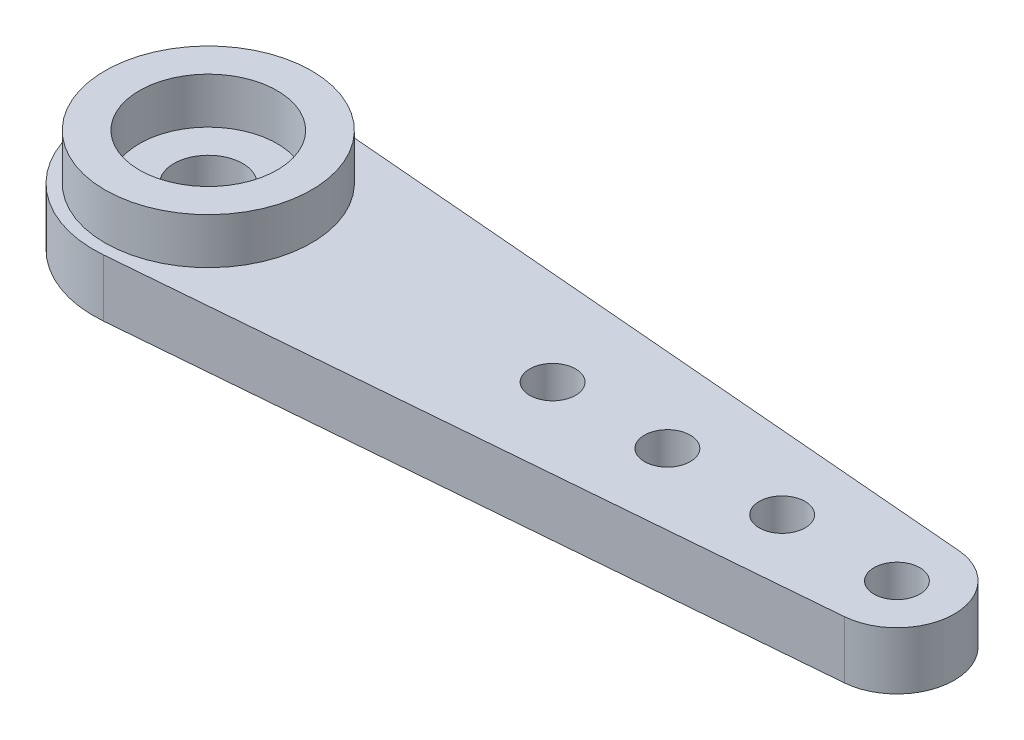
ISO-10303-21;
HEADER;
FILE_DESCRIPTION(('STEP AP214'),'2;1');
FILE_NAME('part.step','',(''),(''),'','','');
FILE_SCHEMA(('AUTOMOTIVE_DESIGN { 1 0 10303 214 1 1 1 1 }'));
ENDSEC;
DATA;
#1=APPLICATION_CONTEXT('core data for automotive mechanical design processes');
#2=APPLICATION_PROTOCOL_DEFINITION('international standard','automotive_design',2000,#1);
#3=PRODUCT_CONTEXT('',#1,'mechanical');
#4=PRODUCT('Part','Part','',(#3));
#5=PRODUCT_RELATED_PRODUCT_CATEGORY('part','',(#4));
#6=PRODUCT_DEFINITION_FORMATION('','',#4);
#7=PRODUCT_DEFINITION_CONTEXT('part definition',#1,'design');
#8=PRODUCT_DEFINITION('design','',#6,#7);
#9=PRODUCT_DEFINITION_SHAPE('','',#8);
#10=(LENGTH_UNIT() NAMED_UNIT(*) SI_UNIT(.MILLI.,.METRE.));
#11=(NAMED_UNIT(*) PLANE_ANGLE_UNIT() SI_UNIT($,.RADIAN.));
#12=(NAMED_UNIT(*) SI_UNIT($,.STERADIAN.) SOLID_ANGLE_UNIT());
#13=UNCERTAINTY_MEASURE_WITH_UNIT(LENGTH_MEASURE(1.E-05),#10,'distance_accuracy_value','');
#14=(GEOMETRIC_REPRESENTATION_CONTEXT(3) GLOBAL_UNCERTAINTY_ASSIGNED_CONTEXT((#13)) GLOBAL_UNIT_ASSIGNED_CONTEXT((#10,
#11,#12)) REPRESENTATION_CONTEXT('',''));
#15=CARTESIAN_POINT('',(0.,0.,0.));
#16=DIRECTION('',(0.,0.,1.));
#17=DIRECTION('',(1.,0.,0.));
#18=AXIS2_PLACEMENT_3D('',#15,#16,#17);
#19=CARTESIAN_POINT('',(-30.,0.,0.));
#20=DIRECTION('',(0.,1.,0.));
#21=DIRECTION('',(0.,0.,1.));
#22=AXIS2_PLACEMENT_3D('',#19,#20,#21);
#23=CYLINDRICAL_SURFACE('',#22,1.5);
#24=CARTESIAN_POINT('',(-30.,2.5,0.));
#25=DIRECTION('',(0.,1.,0.));
#26=DIRECTION('',(0.,0.,1.));
#27=AXIS2_PLACEMENT_3D('',#24,#25,#26);
#28=CIRCLE('',#27,1.5);
#29=CARTESIAN_POINT('',(-30.,2.5,1.5));
#30=VERTEX_POINT('',#29);
#31=EDGE_CURVE('E311',#30,#30,#28,.T.);
#32=ORIENTED_EDGE('',*,*,#31,.T.);
#33=EDGE_LOOP('',(#32));
#34=FACE_BOUND('',#33,.T.);
#35=CARTESIAN_POINT('',(-30.,0.2,0.));
#36=DIRECTION('',(0.,-1.,0.));
#37=DIRECTION('',(0.,0.,-1.));
#38=AXIS2_PLACEMENT_3D('',#35,#36,#37);
#39=CIRCLE('',#38,1.5);
#40=CARTESIAN_POINT('',(-30.,0.2,-1.5));
#41=VERTEX_POINT('',#40);
#42=EDGE_CURVE('E43',#41,#41,#39,.F.);
#43=ORIENTED_EDGE('',*,*,#42,.F.);
#44=EDGE_LOOP('',(#43));
#45=FACE_BOUND('',#44,.T.);
#46=ADVANCED_FACE('F39',(#34,#45),#23,.F.);
#47=CARTESIAN_POINT('',(-30.,2.5,0.));
#48=DIRECTION('',(0.,-1.,0.));
#49=DIRECTION('',(0.,0.,-1.));
#50=AXIS2_PLACEMENT_3D('',#47,#48,#49);
#51=CYLINDRICAL_SURFACE('',#50,5.);
#52=CARTESIAN_POINT('',(-30.,0.,0.));
#53=DIRECTION('',(0.,1.,0.));
#54=DIRECTION('',(0.,0.,1.));
#55=AXIS2_PLACEMENT_3D('',#52,#53,#54);
#56=CIRCLE('',#55,5.);
#57=CARTESIAN_POINT('',(-29.5833333333333,0.,-4.98260864295891));
#58=VERTEX_POINT('',#57);
#59=CARTESIAN_POINT('',(-29.5833333333333,0.,4.98260864295892));
#60=VERTEX_POINT('',#59);
#61=EDGE_CURVE('E121',#58,#60,#56,.T.);
#62=ORIENTED_EDGE('',*,*,#61,.T.);
#63=DIRECTION('',(0.,-1.,0.));
#64=VECTOR('',#63,1.);
#65=CARTESIAN_POINT('',(-29.5833333333333,2.5,4.98260864295892));
#66=LINE('',#65,#64);
#67=CARTESIAN_POINT('',(-29.5833333333333,2.5,4.98260864295892));
#68=VERTEX_POINT('',#67);
#69=EDGE_CURVE('E49',#68,#60,#66,.T.);
#70=ORIENTED_EDGE('',*,*,#69,.F.);
#71=CARTESIAN_POINT('',(-30.,2.5,0.));
#72=DIRECTION('',(0.,1.,0.));
#73=DIRECTION('',(0.,0.,1.));
#74=AXIS2_PLACEMENT_3D('',#71,#72,#73);
#75=CIRCLE('',#74,5.);
#76=CARTESIAN_POINT('',(-29.5833333333333,2.5,-4.98260864295891));
#77=VERTEX_POINT('',#76);
#78=EDGE_CURVE('E93',#77,#68,#75,.T.);
#79=ORIENTED_EDGE('',*,*,#78,.F.);
#80=DIRECTION('',(0.,-1.,0.));
#81=VECTOR('',#80,1.);
#82=CARTESIAN_POINT('',(-29.5833333333333,2.5,-4.98260864295891));
#83=LINE('',#82,#81);
#84=EDGE_CURVE('E58',#77,#58,#83,.T.);
#85=ORIENTED_EDGE('',*,*,#84,.T.);
#86=EDGE_LOOP('',(#62,#70,#79,#85));
#87=FACE_BOUND('',#86,.T.);
#88=ADVANCED_FACE('F41',(#87),#51,.T.);
#89=CARTESIAN_POINT('',(0.208333333333333,2.5,2.49130432147946));
#90=DIRECTION('',(-0.0833333333333334,0.,-0.996521728591783));
#91=DIRECTION('',(-0.996521728591783,0.,0.0833333333333334));
#92=AXIS2_PLACEMENT_3D('',#89,#90,#91);
#93=PLANE('',#92);
#94=DIRECTION('',(0.996521728591783,0.,-0.0833333333333334));
#95=VECTOR('',#94,1.);
#96=CARTESIAN_POINT('',(0.208333333333333,0.,2.49130432147946));
#97=LINE('',#96,#95);
#98=CARTESIAN_POINT('',(0.208333333333335,0.,2.49130432147946));
#99=VERTEX_POINT('',#98);
#100=EDGE_CURVE('E99',#60,#99,#97,.T.);
#101=ORIENTED_EDGE('',*,*,#100,.T.);
#102=DIRECTION('',(0.,-1.,0.));
#103=VECTOR('',#102,1.);
#104=CARTESIAN_POINT('',(0.208333333333335,2.5,2.49130432147946));
#105=LINE('',#104,#103);
#106=CARTESIAN_POINT('',(0.208333333333335,2.5,2.49130432147946));
#107=VERTEX_POINT('',#106);
#108=EDGE_CURVE('E97',#107,#99,#105,.T.);
#109=ORIENTED_EDGE('',*,*,#108,.F.);
#110=DIRECTION('',(0.996521728591783,0.,-0.0833333333333334));
#111=VECTOR('',#110,1.);
#112=CARTESIAN_POINT('',(0.208333333333333,2.5,2.49130432147946));
#113=LINE('',#112,#111);
#114=EDGE_CURVE('E85',#68,#107,#113,.T.);
#115=ORIENTED_EDGE('',*,*,#114,.F.);
#116=ORIENTED_EDGE('',*,*,#69,.T.);
#117=EDGE_LOOP('',(#101,#109,#115,#116));
#118=FACE_BOUND('',#117,.T.);
#119=ADVANCED_FACE('F98',(#118),#93,.F.);
#120=CARTESIAN_POINT('',(0.,2.5,0.));
#121=DIRECTION('',(0.,-1.,0.));
#122=DIRECTION('',(0.,0.,-1.));
#123=AXIS2_PLACEMENT_3D('',#120,#121,#122);
#124=CYLINDRICAL_SURFACE('',#123,2.5);
#125=CARTESIAN_POINT('',(0.,0.,0.));
#126=DIRECTION('',(0.,1.,0.));
#127=DIRECTION('',(0.,0.,1.));
#128=AXIS2_PLACEMENT_3D('',#125,#126,#127);
#129=CIRCLE('',#128,2.5);
#130=CARTESIAN_POINT('',(0.208333333333334,0.,-2.49130432147946));
#131=VERTEX_POINT('',#130);
#132=EDGE_CURVE('E125',#99,#131,#129,.T.);
#133=ORIENTED_EDGE('',*,*,#132,.T.);
#134=DIRECTION('',(0.,-1.,0.));
#135=VECTOR('',#134,1.);
#136=CARTESIAN_POINT('',(0.208333333333334,2.5,-2.49130432147946));
#137=LINE('',#136,#135);
#138=CARTESIAN_POINT('',(0.208333333333334,2.5,-2.49130432147946));
#139=VERTEX_POINT('',#138);
#140=EDGE_CURVE('E73',#139,#131,#137,.T.);
#141=ORIENTED_EDGE('',*,*,#140,.F.);
#142=CARTESIAN_POINT('',(0.,2.5,0.));
#143=DIRECTION('',(0.,1.,0.));
#144=DIRECTION('',(0.,0.,1.));
#145=AXIS2_PLACEMENT_3D('',#142,#143,#144);
#146=CIRCLE('',#145,2.5);
#147=EDGE_CURVE('E92',#107,#139,#146,.T.);
#148=ORIENTED_EDGE('',*,*,#147,.F.);
#149=ORIENTED_EDGE('',*,*,#108,.T.);
#150=EDGE_LOOP('',(#133,#141,#148,#149));
#151=FACE_BOUND('',#150,.T.);
#152=ADVANCED_FACE('F103',(#151),#124,.T.);
#153=CARTESIAN_POINT('',(-5.,2.5,0.));
#154=DIRECTION('',(0.,-1.,0.));
#155=DIRECTION('',(0.,0.,-1.));
#156=AXIS2_PLACEMENT_3D('',#153,#154,#155);
#157=CYLINDRICAL_SURFACE('',#156,1.);
#158=CARTESIAN_POINT('',(-5.,2.5,0.));
#159=DIRECTION('',(0.,1.,0.));
#160=DIRECTION('',(0.,0.,1.));
#161=AXIS2_PLACEMENT_3D('',#158,#159,#160);
#162=CIRCLE('',#161,1.);
#163=CARTESIAN_POINT('',(-5.,2.5,1.00000000000003));
#164=VERTEX_POINT('',#163);
#165=EDGE_CURVE('E115',#164,#164,#162,.T.);
#166=ORIENTED_EDGE('',*,*,#165,.T.);
#167=EDGE_LOOP('',(#166));
#168=FACE_BOUND('',#167,.T.);
#169=CARTESIAN_POINT('',(-5.,0.,0.));
#170=DIRECTION('',(0.,1.,0.));
#171=DIRECTION('',(0.,0.,1.));
#172=AXIS2_PLACEMENT_3D('',#169,#170,#171);
#173=CIRCLE('',#172,1.);
#174=CARTESIAN_POINT('',(-5.,0.,1.00000000000003));
#175=VERTEX_POINT('',#174);
#176=EDGE_CURVE('E136',#175,#175,#173,.T.);
#177=ORIENTED_EDGE('',*,*,#176,.F.);
#178=EDGE_LOOP('',(#177));
#179=FACE_BOUND('',#178,.T.);
#180=ADVANCED_FACE('F192',(#168,#179),#157,.F.);
#181=CARTESIAN_POINT('',(-10.,2.5,0.));
#182=DIRECTION('',(0.,-1.,0.));
#183=DIRECTION('',(0.,0.,-1.));
#184=AXIS2_PLACEMENT_3D('',#181,#182,#183);
#185=CYLINDRICAL_SURFACE('',#184,1.);
#186=CARTESIAN_POINT('',(-10.,2.5,0.));
#187=DIRECTION('',(0.,1.,0.));
#188=DIRECTION('',(0.,0.,1.));
#189=AXIS2_PLACEMENT_3D('',#186,#187,#188);
#190=CIRCLE('',#189,1.);
#191=CARTESIAN_POINT('',(-10.,2.5,1.00000000000007));
#192=VERTEX_POINT('',#191);
#193=EDGE_CURVE('E112',#192,#192,#190,.T.);
#194=ORIENTED_EDGE('',*,*,#193,.T.);
#195=EDGE_LOOP('',(#194));
#196=FACE_BOUND('',#195,.T.);
#197=CARTESIAN_POINT('',(-10.,0.,0.));
#198=DIRECTION('',(0.,1.,0.));
#199=DIRECTION('',(0.,0.,1.));
#200=AXIS2_PLACEMENT_3D('',#197,#198,#199);
#201=CIRCLE('',#200,1.);
#202=CARTESIAN_POINT('',(-10.,0.,1.00000000000007));
#203=VERTEX_POINT('',#202);
#204=EDGE_CURVE('E133',#203,#203,#201,.T.);
#205=ORIENTED_EDGE('',*,*,#204,.F.);
#206=EDGE_LOOP('',(#205));
#207=FACE_BOUND('',#206,.T.);
#208=ADVANCED_FACE('F157',(#196,#207),#185,.F.);
#209=CARTESIAN_POINT('',(-15.,2.5,1.04744440165294E-13));
#210=DIRECTION('',(0.,-1.,0.));
#211=DIRECTION('',(0.,0.,-1.));
#212=AXIS2_PLACEMENT_3D('',#209,#210,#211);
#213=CYLINDRICAL_SURFACE('',#212,1.);
#214=CARTESIAN_POINT('',(-15.,2.5,1.04744440165294E-13));
#215=DIRECTION('',(0.,1.,0.));
#216=DIRECTION('',(0.,0.,1.));
#217=AXIS2_PLACEMENT_3D('',#214,#215,#216);
#218=CIRCLE('',#217,1.);
#219=CARTESIAN_POINT('',(-15.,2.5,1.0000000000001));
#220=VERTEX_POINT('',#219);
#221=EDGE_CURVE('E106',#220,#220,#218,.T.);
#222=ORIENTED_EDGE('',*,*,#221,.T.);
#223=EDGE_LOOP('',(#222));
#224=FACE_BOUND('',#223,.T.);
#225=CARTESIAN_POINT('',(-15.,0.,1.04744440165294E-13));
#226=DIRECTION('',(0.,1.,0.));
#227=DIRECTION('',(0.,0.,1.));
#228=AXIS2_PLACEMENT_3D('',#225,#226,#227);
#229=CIRCLE('',#228,1.);
#230=CARTESIAN_POINT('',(-15.,0.,1.0000000000001));
#231=VERTEX_POINT('',#230);
#232=EDGE_CURVE('E130',#231,#231,#229,.T.);
#233=ORIENTED_EDGE('',*,*,#232,.F.);
#234=EDGE_LOOP('',(#233));
#235=FACE_BOUND('',#234,.T.);
#236=ADVANCED_FACE('F149',(#224,#235),#213,.F.);
#237=CARTESIAN_POINT('',(0.208333333333333,2.5,-2.49130432147946));
#238=DIRECTION('',(0.0833333333333331,0.,-0.996521728591783));
#239=DIRECTION('',(-0.996521728591783,0.,-0.0833333333333331));
#240=AXIS2_PLACEMENT_3D('',#237,#238,#239);
#241=PLANE('',#240);
#242=DIRECTION('',(0.996521728591783,0.,0.0833333333333331));
#243=VECTOR('',#242,1.);
#244=CARTESIAN_POINT('',(0.208333333333333,0.,-2.49130432147946));
#245=LINE('',#244,#243);
#246=EDGE_CURVE('E127',#58,#131,#245,.T.);
#247=ORIENTED_EDGE('',*,*,#246,.F.);
#248=ORIENTED_EDGE('',*,*,#84,.F.);
#249=DIRECTION('',(0.996521728591783,0.,0.0833333333333331));
#250=VECTOR('',#249,1.);
#251=CARTESIAN_POINT('',(0.208333333333333,2.5,-2.49130432147946));
#252=LINE('',#251,#250);
#253=EDGE_CURVE('E104',#77,#139,#252,.T.);
#254=ORIENTED_EDGE('',*,*,#253,.T.);
#255=ORIENTED_EDGE('',*,*,#140,.T.);
#256=EDGE_LOOP('',(#247,#248,#254,#255));
#257=FACE_BOUND('',#256,.T.);
#258=ADVANCED_FACE('F146',(#257),#241,.T.);
#259=CARTESIAN_POINT('',(0.,2.5,0.));
#260=DIRECTION('',(0.,-1.,0.));
#261=DIRECTION('',(0.,0.,-1.));
#262=AXIS2_PLACEMENT_3D('',#259,#260,#261);
#263=CYLINDRICAL_SURFACE('',#262,1.);
#264=CARTESIAN_POINT('',(0.,2.5,0.));
#265=DIRECTION('',(0.,1.,0.));
#266=DIRECTION('',(0.,0.,1.));
#267=AXIS2_PLACEMENT_3D('',#264,#265,#266);
#268=CIRCLE('',#267,1.);
#269=CARTESIAN_POINT('',(0.,2.5,1.));
#270=VERTEX_POINT('',#269);
#271=EDGE_CURVE('E118',#270,#270,#268,.T.);
#272=ORIENTED_EDGE('',*,*,#271,.T.);
#273=EDGE_LOOP('',(#272));
#274=FACE_BOUND('',#273,.T.);
#275=CARTESIAN_POINT('',(0.,0.,0.));
#276=DIRECTION('',(0.,1.,0.));
#277=DIRECTION('',(0.,0.,1.));
#278=AXIS2_PLACEMENT_3D('',#275,#276,#277);
#279=CIRCLE('',#278,1.);
#280=CARTESIAN_POINT('',(0.,0.,1.));
#281=VERTEX_POINT('',#280);
#282=EDGE_CURVE('E139',#281,#281,#279,.T.);
#283=ORIENTED_EDGE('',*,*,#282,.F.);
#284=EDGE_LOOP('',(#283));
#285=FACE_BOUND('',#284,.T.);
#286=ADVANCED_FACE('F148',(#274,#285),#263,.F.);
#287=CARTESIAN_POINT('',(0.,2.5,0.));
#288=DIRECTION('',(0.,1.,0.));
#289=DIRECTION('',(0.,0.,1.));
#290=AXIS2_PLACEMENT_3D('',#287,#288,#289);
#291=PLANE('',#290);
#292=CARTESIAN_POINT('',(-30.,2.5,0.));
#293=DIRECTION('',(0.,1.,0.));
#294=DIRECTION('',(0.,0.,1.));
#295=AXIS2_PLACEMENT_3D('',#292,#293,#294);
#296=CIRCLE('',#295,4.5);
#297=CARTESIAN_POINT('',(-30.,2.5,4.5));
#298=VERTEX_POINT('',#297);
#299=EDGE_CURVE('E11',#298,#298,#296,.T.);
#300=ORIENTED_EDGE('',*,*,#299,.F.);
#301=EDGE_LOOP('',(#300));
#302=FACE_BOUND('',#301,.T.);
#303=ORIENTED_EDGE('',*,*,#78,.T.);
#304=ORIENTED_EDGE('',*,*,#114,.T.);
#305=ORIENTED_EDGE('',*,*,#147,.T.);
#306=ORIENTED_EDGE('',*,*,#253,.F.);
#307=EDGE_LOOP('',(#303,#304,#305,#306));
#308=FACE_BOUND('',#307,.T.);
#309=ORIENTED_EDGE('',*,*,#221,.F.);
#310=EDGE_LOOP('',(#309));
#311=FACE_BOUND('',#310,.T.);
#312=ORIENTED_EDGE('',*,*,#193,.F.);
#313=EDGE_LOOP('',(#312));
#314=FACE_BOUND('',#313,.T.);
#315=ORIENTED_EDGE('',*,*,#165,.F.);
#316=EDGE_LOOP('',(#315));
#317=FACE_BOUND('',#316,.T.);
#318=ORIENTED_EDGE('',*,*,#271,.F.);
#319=EDGE_LOOP('',(#318));
#320=FACE_BOUND('',#319,.T.);
#321=ADVANCED_FACE('F88',(#302,#308,#311,#314,#317,#320),#291,.T.);
#322=CARTESIAN_POINT('',(0.,0.,0.));
#323=DIRECTION('',(0.,1.,0.));
#324=DIRECTION('',(0.,0.,1.));
#325=AXIS2_PLACEMENT_3D('',#322,#323,#324);
#326=PLANE('',#325);
#327=CARTESIAN_POINT('',(-30.,0.,0.));
#328=DIRECTION('',(0.,-1.,0.));
#329=DIRECTION('',(0.,0.,-1.));
#330=AXIS2_PLACEMENT_3D('',#327,#328,#329);
#331=CIRCLE('',#330,3.5);
#332=CARTESIAN_POINT('',(-30.,0.,-3.5));
#333=VERTEX_POINT('',#332);
#334=EDGE_CURVE('E307',#333,#333,#331,.T.);
#335=ORIENTED_EDGE('',*,*,#334,.F.);
#336=EDGE_LOOP('',(#335));
#337=FACE_BOUND('',#336,.T.);
#338=ORIENTED_EDGE('',*,*,#61,.F.);
#339=ORIENTED_EDGE('',*,*,#246,.T.);
#340=ORIENTED_EDGE('',*,*,#132,.F.);
#341=ORIENTED_EDGE('',*,*,#100,.F.);
#342=EDGE_LOOP('',(#338,#339,#340,#341));
#343=FACE_BOUND('',#342,.T.);
#344=ORIENTED_EDGE('',*,*,#232,.T.);
#345=EDGE_LOOP('',(#344));
#346=FACE_BOUND('',#345,.T.);
#347=ORIENTED_EDGE('',*,*,#204,.T.);
#348=EDGE_LOOP('',(#347));
#349=FACE_BOUND('',#348,.T.);
#350=ORIENTED_EDGE('',*,*,#176,.T.);
#351=EDGE_LOOP('',(#350));
#352=FACE_BOUND('',#351,.T.);
#353=ORIENTED_EDGE('',*,*,#282,.T.);
#354=EDGE_LOOP('',(#353));
#355=FACE_BOUND('',#354,.T.);
#356=ADVANCED_FACE('F144',(#337,#343,#346,#349,#352,#355),#326,.F.);
#357=CARTESIAN_POINT('',(-30.,4.5,0.));
#358=DIRECTION('',(0.,1.,0.));
#359=DIRECTION('',(0.,0.,1.));
#360=AXIS2_PLACEMENT_3D('',#357,#358,#359);
#361=PLANE('',#360);
#362=CARTESIAN_POINT('',(-30.,4.5,0.));
#363=DIRECTION('',(0.,1.,0.));
#364=DIRECTION('',(0.,0.,1.));
#365=AXIS2_PLACEMENT_3D('',#362,#363,#364);
#366=CIRCLE('',#365,4.5);
#367=CARTESIAN_POINT('',(-30.,4.5,4.5));
#368=VERTEX_POINT('',#367);
#369=EDGE_CURVE('E123',#368,#368,#366,.T.);
#370=ORIENTED_EDGE('',*,*,#369,.T.);
#371=EDGE_LOOP('',(#370));
#372=FACE_BOUND('',#371,.T.);
#373=CARTESIAN_POINT('',(-30.,4.5,0.));
#374=DIRECTION('',(0.,1.,0.));
#375=DIRECTION('',(0.,0.,1.));
#376=AXIS2_PLACEMENT_3D('',#373,#374,#375);
#377=CIRCLE('',#376,3.);
#378=CARTESIAN_POINT('',(-30.,4.5,3.));
#379=VERTEX_POINT('',#378);
#380=EDGE_CURVE('E314',#379,#379,#377,.T.);
#381=ORIENTED_EDGE('',*,*,#380,.F.);
#382=EDGE_LOOP('',(#381));
#383=FACE_BOUND('',#382,.T.);
#384=ADVANCED_FACE('F179',(#372,#383),#361,.T.);
#385=CARTESIAN_POINT('',(-30.,4.5,0.));
#386=DIRECTION('',(0.,-1.,0.));
#387=DIRECTION('',(0.,0.,-1.));
#388=AXIS2_PLACEMENT_3D('',#385,#386,#387);
#389=CYLINDRICAL_SURFACE('',#388,4.5);
#390=ORIENTED_EDGE('',*,*,#369,.F.);
#391=EDGE_LOOP('',(#390));
#392=FACE_BOUND('',#391,.T.);
#393=ORIENTED_EDGE('',*,*,#299,.T.);
#394=EDGE_LOOP('',(#393));
#395=FACE_BOUND('',#394,.T.);
#396=ADVANCED_FACE('F177',(#392,#395),#389,.T.);
#397=CARTESIAN_POINT('',(-30.,4.5,0.));
#398=DIRECTION('',(0.,-1.,0.));
#399=DIRECTION('',(0.,0.,-1.));
#400=AXIS2_PLACEMENT_3D('',#397,#398,#399);
#401=CYLINDRICAL_SURFACE('',#400,3.);
#402=ORIENTED_EDGE('',*,*,#380,.T.);
#403=EDGE_LOOP('',(#402));
#404=FACE_BOUND('',#403,.T.);
#405=CARTESIAN_POINT('',(-30.,2.5,0.));
#406=DIRECTION('',(0.,1.,0.));
#407=DIRECTION('',(0.,0.,1.));
#408=AXIS2_PLACEMENT_3D('',#405,#406,#407);
#409=CIRCLE('',#408,3.);
#410=CARTESIAN_POINT('',(-30.,2.5,3.));
#411=VERTEX_POINT('',#410);
#412=EDGE_CURVE('E313',#411,#411,#409,.T.);
#413=ORIENTED_EDGE('',*,*,#412,.F.);
#414=EDGE_LOOP('',(#413));
#415=FACE_BOUND('',#414,.T.);
#416=ADVANCED_FACE('F173',(#404,#415),#401,.F.);
#417=ORIENTED_EDGE('',*,*,#31,.F.);
#418=EDGE_LOOP('',(#417));
#419=FACE_BOUND('',#418,.T.);
#420=ORIENTED_EDGE('',*,*,#412,.T.);
#421=EDGE_LOOP('',(#420));
#422=FACE_BOUND('',#421,.T.);
#423=ADVANCED_FACE('F176',(#419,#422),#291,.T.);
#424=CARTESIAN_POINT('',(-30.,0.2,0.));
#425=DIRECTION('',(0.,-1.,0.));
#426=DIRECTION('',(0.,0.,-1.));
#427=AXIS2_PLACEMENT_3D('',#424,#425,#426);
#428=PLANE('',#427);
#429=CARTESIAN_POINT('',(-30.,0.2,0.));
#430=DIRECTION('',(0.,-1.,0.));
#431=DIRECTION('',(0.,0.,-1.));
#432=AXIS2_PLACEMENT_3D('',#429,#430,#431);
#433=CIRCLE('',#432,3.5);
#434=CARTESIAN_POINT('',(-30.,0.2,-3.5));
#435=VERTEX_POINT('',#434);
#436=EDGE_CURVE('E304',#435,#435,#433,.T.);
#437=ORIENTED_EDGE('',*,*,#436,.T.);
#438=EDGE_LOOP('',(#437));
#439=FACE_BOUND('',#438,.T.);
#440=ORIENTED_EDGE('',*,*,#42,.T.);
#441=EDGE_LOOP('',(#440));
#442=FACE_BOUND('',#441,.T.);
#443=ADVANCED_FACE('F268',(#439,#442),#428,.T.);
#444=CARTESIAN_POINT('',(-30.,0.2,0.));
#445=DIRECTION('',(0.,-1.,0.));
#446=DIRECTION('',(0.,0.,-1.));
#447=AXIS2_PLACEMENT_3D('',#444,#445,#446);
#448=CYLINDRICAL_SURFACE('',#447,3.5);
#449=ORIENTED_EDGE('',*,*,#436,.F.);
#450=EDGE_LOOP('',(#449));
#451=FACE_BOUND('',#450,.T.);
#452=ORIENTED_EDGE('',*,*,#334,.T.);
#453=EDGE_LOOP('',(#452));
#454=FACE_BOUND('',#453,.T.);
#455=ADVANCED_FACE('F171',(#451,#454),#448,.F.);
#456=CLOSED_SHELL('',(#46,#88,#119,#152,#180,#208,#236,#258,#286,#321,#356,#384,#396,#416,#423,
#443,#455));
#457=MANIFOLD_SOLID_BREP('B2',#456);
#458=ADVANCED_BREP_SHAPE_REPRESENTATION('',(#18,#457),#14);
#459=SHAPE_DEFINITION_REPRESENTATION(#9,#458);
ENDSEC;
END-ISO-10303-21;
